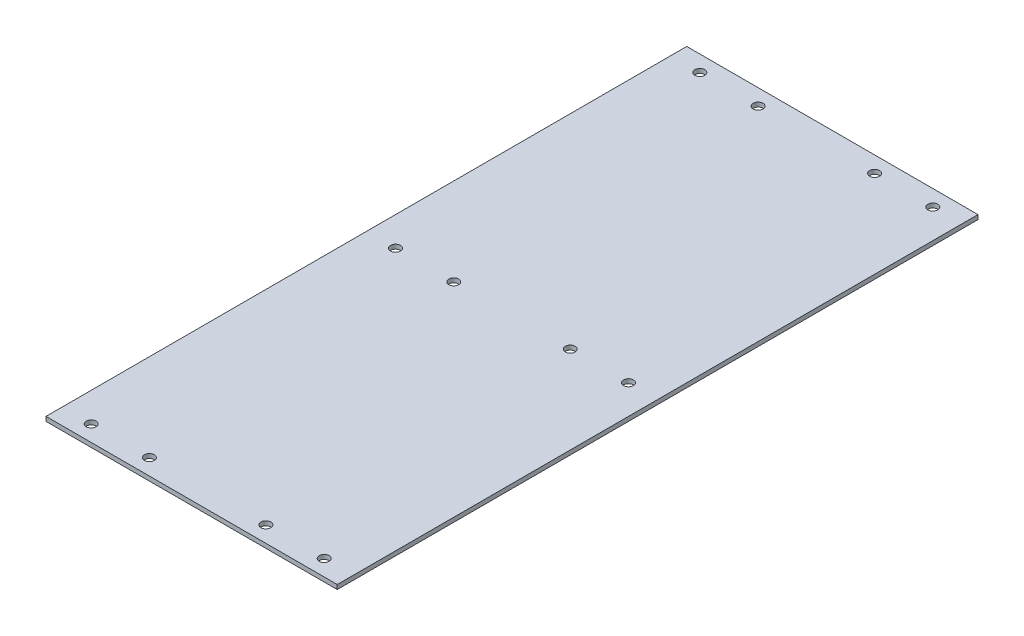
ISO-10303-21;
HEADER;
FILE_DESCRIPTION(('STEP AP214'),'2;1');
FILE_NAME('part.step','',(''),(''),'','','');
FILE_SCHEMA(('AUTOMOTIVE_DESIGN { 1 0 10303 214 1 1 1 1 }'));
ENDSEC;
DATA;
#1=APPLICATION_CONTEXT('core data for automotive mechanical design processes');
#2=APPLICATION_PROTOCOL_DEFINITION('international standard','automotive_design',2000,#1);
#3=PRODUCT_CONTEXT('',#1,'mechanical');
#4=PRODUCT('Part','Part','',(#3));
#5=PRODUCT_RELATED_PRODUCT_CATEGORY('part','',(#4));
#6=PRODUCT_DEFINITION_FORMATION('','',#4);
#7=PRODUCT_DEFINITION_CONTEXT('part definition',#1,'design');
#8=PRODUCT_DEFINITION('design','',#6,#7);
#9=PRODUCT_DEFINITION_SHAPE('','',#8);
#10=(LENGTH_UNIT() NAMED_UNIT(*) SI_UNIT(.MILLI.,.METRE.));
#11=(NAMED_UNIT(*) PLANE_ANGLE_UNIT() SI_UNIT($,.RADIAN.));
#12=(NAMED_UNIT(*) SI_UNIT($,.STERADIAN.) SOLID_ANGLE_UNIT());
#13=UNCERTAINTY_MEASURE_WITH_UNIT(LENGTH_MEASURE(1.E-05),#10,'distance_accuracy_value','');
#14=(GEOMETRIC_REPRESENTATION_CONTEXT(3) GLOBAL_UNCERTAINTY_ASSIGNED_CONTEXT((#13)) GLOBAL_UNIT_ASSIGNED_CONTEXT((#10,
#11,#12)) REPRESENTATION_CONTEXT('',''));
#15=CARTESIAN_POINT('',(0.,0.,0.));
#16=DIRECTION('',(0.,0.,1.));
#17=DIRECTION('',(1.,0.,0.));
#18=AXIS2_PLACEMENT_3D('',#15,#16,#17);
#19=CARTESIAN_POINT('',(-50.,46.95,-168.5));
#20=DIRECTION('',(-1.,0.,0.));
#21=DIRECTION('',(0.,0.,1.));
#22=AXIS2_PLACEMENT_3D('',#19,#20,#21);
#23=PLANE('',#22);
#24=DIRECTION('',(0.,-1.,0.));
#25=VECTOR('',#24,1.);
#26=CARTESIAN_POINT('',(-50.,46.95,51.5));
#27=LINE('',#26,#25);
#28=CARTESIAN_POINT('',(-50.,46.95,51.5));
#29=VERTEX_POINT('',#28);
#30=CARTESIAN_POINT('',(-50.,45.45,51.5));
#31=VERTEX_POINT('',#30);
#32=EDGE_CURVE('E85',#29,#31,#27,.T.);
#33=ORIENTED_EDGE('',*,*,#32,.F.);
#34=DIRECTION('',(0.,0.,1.));
#35=VECTOR('',#34,1.);
#36=CARTESIAN_POINT('',(-50.,46.95,-168.5));
#37=LINE('',#36,#35);
#38=CARTESIAN_POINT('',(-50.,46.95,-168.5));
#39=VERTEX_POINT('',#38);
#40=EDGE_CURVE('E20',#39,#29,#37,.T.);
#41=ORIENTED_EDGE('',*,*,#40,.F.);
#42=DIRECTION('',(0.,-1.,0.));
#43=VECTOR('',#42,1.);
#44=CARTESIAN_POINT('',(-50.,46.95,-168.5));
#45=LINE('',#44,#43);
#46=CARTESIAN_POINT('',(-50.,45.45,-168.5));
#47=VERTEX_POINT('',#46);
#48=EDGE_CURVE('E70',#39,#47,#45,.T.);
#49=ORIENTED_EDGE('',*,*,#48,.T.);
#50=DIRECTION('',(0.,0.,1.));
#51=VECTOR('',#50,1.);
#52=CARTESIAN_POINT('',(-50.,45.45,-168.5));
#53=LINE('',#52,#51);
#54=EDGE_CURVE('E11',#47,#31,#53,.T.);
#55=ORIENTED_EDGE('',*,*,#54,.T.);
#56=EDGE_LOOP('',(#33,#41,#49,#55));
#57=FACE_BOUND('',#56,.T.);
#58=ADVANCED_FACE('F17',(#57),#23,.T.);
#59=CARTESIAN_POINT('',(-46.3303607703069,45.45,-168.5));
#60=DIRECTION('',(0.,-1.,0.));
#61=DIRECTION('',(0.,0.,-1.));
#62=AXIS2_PLACEMENT_3D('',#59,#60,#61);
#63=PLANE('',#62);
#64=CARTESIAN_POINT('',(-40.,45.45,46.));
#65=DIRECTION('',(0.,-1.,0.));
#66=DIRECTION('',(0.,0.,-1.));
#67=AXIS2_PLACEMENT_3D('',#64,#65,#66);
#68=CIRCLE('',#67,1.7);
#69=CARTESIAN_POINT('',(-40.,45.45,44.3));
#70=VERTEX_POINT('',#69);
#71=EDGE_CURVE('E313',#70,#70,#68,.T.);
#72=ORIENTED_EDGE('',*,*,#71,.F.);
#73=EDGE_LOOP('',(#72));
#74=FACE_BOUND('',#73,.T.);
#75=CARTESIAN_POINT('',(-40.,45.45,-58.5));
#76=DIRECTION('',(0.,-1.,0.));
#77=DIRECTION('',(0.,0.,-1.));
#78=AXIS2_PLACEMENT_3D('',#75,#76,#77);
#79=CIRCLE('',#78,1.7);
#80=CARTESIAN_POINT('',(-40.,45.45,-60.2));
#81=VERTEX_POINT('',#80);
#82=EDGE_CURVE('E323',#81,#81,#79,.T.);
#83=ORIENTED_EDGE('',*,*,#82,.F.);
#84=EDGE_LOOP('',(#83));
#85=FACE_BOUND('',#84,.T.);
#86=CARTESIAN_POINT('',(-40.,45.45,-163.));
#87=DIRECTION('',(0.,-1.,0.));
#88=DIRECTION('',(0.,0.,-1.));
#89=AXIS2_PLACEMENT_3D('',#86,#87,#88);
#90=CIRCLE('',#89,1.7);
#91=CARTESIAN_POINT('',(-40.,45.45,-164.7));
#92=VERTEX_POINT('',#91);
#93=EDGE_CURVE('E329',#92,#92,#90,.T.);
#94=ORIENTED_EDGE('',*,*,#93,.F.);
#95=EDGE_LOOP('',(#94));
#96=FACE_BOUND('',#95,.T.);
#97=CARTESIAN_POINT('',(40.,45.45,-163.));
#98=DIRECTION('',(0.,-1.,0.));
#99=DIRECTION('',(0.,0.,-1.));
#100=AXIS2_PLACEMENT_3D('',#97,#98,#99);
#101=CIRCLE('',#100,1.7);
#102=CARTESIAN_POINT('',(40.,45.45,-164.7));
#103=VERTEX_POINT('',#102);
#104=EDGE_CURVE('E335',#103,#103,#101,.T.);
#105=ORIENTED_EDGE('',*,*,#104,.F.);
#106=EDGE_LOOP('',(#105));
#107=FACE_BOUND('',#106,.T.);
#108=CARTESIAN_POINT('',(40.,45.45,-58.5));
#109=DIRECTION('',(0.,-1.,0.));
#110=DIRECTION('',(0.,0.,-1.));
#111=AXIS2_PLACEMENT_3D('',#108,#109,#110);
#112=CIRCLE('',#111,1.7);
#113=CARTESIAN_POINT('',(40.,45.45,-60.2));
#114=VERTEX_POINT('',#113);
#115=EDGE_CURVE('E341',#114,#114,#112,.T.);
#116=ORIENTED_EDGE('',*,*,#115,.F.);
#117=EDGE_LOOP('',(#116));
#118=FACE_BOUND('',#117,.T.);
#119=CARTESIAN_POINT('',(40.,45.45,46.));
#120=DIRECTION('',(0.,-1.,0.));
#121=DIRECTION('',(0.,0.,-1.));
#122=AXIS2_PLACEMENT_3D('',#119,#120,#121);
#123=CIRCLE('',#122,1.7);
#124=CARTESIAN_POINT('',(40.,45.45,44.3));
#125=VERTEX_POINT('',#124);
#126=EDGE_CURVE('E347',#125,#125,#123,.T.);
#127=ORIENTED_EDGE('',*,*,#126,.F.);
#128=EDGE_LOOP('',(#127));
#129=FACE_BOUND('',#128,.T.);
#130=CARTESIAN_POINT('',(-20.,45.45,-163.));
#131=DIRECTION('',(0.,-1.,0.));
#132=DIRECTION('',(0.,0.,-1.));
#133=AXIS2_PLACEMENT_3D('',#130,#131,#132);
#134=CIRCLE('',#133,1.7);
#135=CARTESIAN_POINT('',(-20.,45.45,-164.7));
#136=VERTEX_POINT('',#135);
#137=EDGE_CURVE('E353',#136,#136,#134,.T.);
#138=ORIENTED_EDGE('',*,*,#137,.F.);
#139=EDGE_LOOP('',(#138));
#140=FACE_BOUND('',#139,.T.);
#141=CARTESIAN_POINT('',(20.,45.45,-163.));
#142=DIRECTION('',(0.,-1.,0.));
#143=DIRECTION('',(0.,0.,-1.));
#144=AXIS2_PLACEMENT_3D('',#141,#142,#143);
#145=CIRCLE('',#144,1.7);
#146=CARTESIAN_POINT('',(20.,45.45,-164.7));
#147=VERTEX_POINT('',#146);
#148=EDGE_CURVE('E359',#147,#147,#145,.T.);
#149=ORIENTED_EDGE('',*,*,#148,.F.);
#150=EDGE_LOOP('',(#149));
#151=FACE_BOUND('',#150,.T.);
#152=CARTESIAN_POINT('',(20.,45.45,-58.5));
#153=DIRECTION('',(0.,-1.,0.));
#154=DIRECTION('',(0.,0.,-1.));
#155=AXIS2_PLACEMENT_3D('',#152,#153,#154);
#156=CIRCLE('',#155,1.7);
#157=CARTESIAN_POINT('',(20.,45.45,-60.2));
#158=VERTEX_POINT('',#157);
#159=EDGE_CURVE('E365',#158,#158,#156,.T.);
#160=ORIENTED_EDGE('',*,*,#159,.F.);
#161=EDGE_LOOP('',(#160));
#162=FACE_BOUND('',#161,.T.);
#163=CARTESIAN_POINT('',(-20.,45.45,-58.5));
#164=DIRECTION('',(0.,-1.,0.));
#165=DIRECTION('',(0.,0.,-1.));
#166=AXIS2_PLACEMENT_3D('',#163,#164,#165);
#167=CIRCLE('',#166,1.7);
#168=CARTESIAN_POINT('',(-20.,45.45,-60.2));
#169=VERTEX_POINT('',#168);
#170=EDGE_CURVE('E371',#169,#169,#167,.T.);
#171=ORIENTED_EDGE('',*,*,#170,.F.);
#172=EDGE_LOOP('',(#171));
#173=FACE_BOUND('',#172,.T.);
#174=CARTESIAN_POINT('',(-20.,45.45,46.));
#175=DIRECTION('',(0.,-1.,0.));
#176=DIRECTION('',(0.,0.,-1.));
#177=AXIS2_PLACEMENT_3D('',#174,#175,#176);
#178=CIRCLE('',#177,1.7);
#179=CARTESIAN_POINT('',(-20.,45.45,44.3));
#180=VERTEX_POINT('',#179);
#181=EDGE_CURVE('E377',#180,#180,#178,.T.);
#182=ORIENTED_EDGE('',*,*,#181,.F.);
#183=EDGE_LOOP('',(#182));
#184=FACE_BOUND('',#183,.T.);
#185=CARTESIAN_POINT('',(20.,45.45,46.));
#186=DIRECTION('',(0.,-1.,0.));
#187=DIRECTION('',(0.,0.,-1.));
#188=AXIS2_PLACEMENT_3D('',#185,#186,#187);
#189=CIRCLE('',#188,1.7);
#190=CARTESIAN_POINT('',(20.,45.45,44.3));
#191=VERTEX_POINT('',#190);
#192=EDGE_CURVE('E79',#191,#191,#189,.T.);
#193=ORIENTED_EDGE('',*,*,#192,.F.);
#194=EDGE_LOOP('',(#193));
#195=FACE_BOUND('',#194,.T.);
#196=DIRECTION('',(1.,0.,0.));
#197=VECTOR('',#196,1.);
#198=CARTESIAN_POINT('',(-46.3303607703069,45.45,51.5));
#199=LINE('',#198,#197);
#200=CARTESIAN_POINT('',(50.,45.45,51.5));
#201=VERTEX_POINT('',#200);
#202=EDGE_CURVE('E63',#31,#201,#199,.T.);
#203=ORIENTED_EDGE('',*,*,#202,.F.);
#204=ORIENTED_EDGE('',*,*,#54,.F.);
#205=DIRECTION('',(1.,0.,0.));
#206=VECTOR('',#205,1.);
#207=CARTESIAN_POINT('',(-50.,45.45,-168.5));
#208=LINE('',#207,#206);
#209=CARTESIAN_POINT('',(50.,45.45,-168.5));
#210=VERTEX_POINT('',#209);
#211=EDGE_CURVE('E61',#47,#210,#208,.T.);
#212=ORIENTED_EDGE('',*,*,#211,.T.);
#213=DIRECTION('',(0.,0.,1.));
#214=VECTOR('',#213,1.);
#215=CARTESIAN_POINT('',(50.,45.45,-168.5));
#216=LINE('',#215,#214);
#217=EDGE_CURVE('E26',#210,#201,#216,.T.);
#218=ORIENTED_EDGE('',*,*,#217,.T.);
#219=EDGE_LOOP('',(#203,#204,#212,#218));
#220=FACE_BOUND('',#219,.T.);
#221=ADVANCED_FACE('F60',(#74,#85,#96,#107,#118,#129,#140,#151,#162,#173,#184,#195,#220),#63,.T.);
#222=CARTESIAN_POINT('',(50.,45.45,-168.5));
#223=DIRECTION('',(1.,0.,0.));
#224=DIRECTION('',(0.,0.,-1.));
#225=AXIS2_PLACEMENT_3D('',#222,#223,#224);
#226=PLANE('',#225);
#227=DIRECTION('',(0.,1.,0.));
#228=VECTOR('',#227,1.);
#229=CARTESIAN_POINT('',(50.,45.45,51.5));
#230=LINE('',#229,#228);
#231=CARTESIAN_POINT('',(50.,46.95,51.5));
#232=VERTEX_POINT('',#231);
#233=EDGE_CURVE('E76',#201,#232,#230,.T.);
#234=ORIENTED_EDGE('',*,*,#233,.F.);
#235=ORIENTED_EDGE('',*,*,#217,.F.);
#236=DIRECTION('',(0.,1.,0.));
#237=VECTOR('',#236,1.);
#238=CARTESIAN_POINT('',(50.,45.45,-168.5));
#239=LINE('',#238,#237);
#240=CARTESIAN_POINT('',(50.,46.95,-168.5));
#241=VERTEX_POINT('',#240);
#242=EDGE_CURVE('E71',#210,#241,#239,.T.);
#243=ORIENTED_EDGE('',*,*,#242,.T.);
#244=DIRECTION('',(0.,0.,1.));
#245=VECTOR('',#244,1.);
#246=CARTESIAN_POINT('',(50.,46.95,-168.5));
#247=LINE('',#246,#245);
#248=EDGE_CURVE('E34',#241,#232,#247,.T.);
#249=ORIENTED_EDGE('',*,*,#248,.T.);
#250=EDGE_LOOP('',(#234,#235,#243,#249));
#251=FACE_BOUND('',#250,.T.);
#252=ADVANCED_FACE('F94',(#251),#226,.T.);
#253=CARTESIAN_POINT('',(50.,46.95,-168.5));
#254=DIRECTION('',(0.,1.,0.));
#255=DIRECTION('',(0.,0.,1.));
#256=AXIS2_PLACEMENT_3D('',#253,#254,#255);
#257=PLANE('',#256);
#258=CARTESIAN_POINT('',(-40.,46.95,46.));
#259=DIRECTION('',(0.,-1.,0.));
#260=DIRECTION('',(0.,0.,-1.));
#261=AXIS2_PLACEMENT_3D('',#258,#259,#260);
#262=CIRCLE('',#261,1.7);
#263=CARTESIAN_POINT('',(-40.,46.95,44.3));
#264=VERTEX_POINT('',#263);
#265=EDGE_CURVE('E316',#264,#264,#262,.T.);
#266=ORIENTED_EDGE('',*,*,#265,.T.);
#267=EDGE_LOOP('',(#266));
#268=FACE_BOUND('',#267,.T.);
#269=CARTESIAN_POINT('',(-40.,46.95,-58.5));
#270=DIRECTION('',(0.,-1.,0.));
#271=DIRECTION('',(0.,0.,-1.));
#272=AXIS2_PLACEMENT_3D('',#269,#270,#271);
#273=CIRCLE('',#272,1.7);
#274=CARTESIAN_POINT('',(-40.,46.95,-60.2));
#275=VERTEX_POINT('',#274);
#276=EDGE_CURVE('E318',#275,#275,#273,.T.);
#277=ORIENTED_EDGE('',*,*,#276,.T.);
#278=EDGE_LOOP('',(#277));
#279=FACE_BOUND('',#278,.T.);
#280=CARTESIAN_POINT('',(-40.,46.95,-163.));
#281=DIRECTION('',(0.,-1.,0.));
#282=DIRECTION('',(0.,0.,-1.));
#283=AXIS2_PLACEMENT_3D('',#280,#281,#282);
#284=CIRCLE('',#283,1.7);
#285=CARTESIAN_POINT('',(-40.,46.95,-164.7));
#286=VERTEX_POINT('',#285);
#287=EDGE_CURVE('E326',#286,#286,#284,.T.);
#288=ORIENTED_EDGE('',*,*,#287,.T.);
#289=EDGE_LOOP('',(#288));
#290=FACE_BOUND('',#289,.T.);
#291=CARTESIAN_POINT('',(40.,46.95,-163.));
#292=DIRECTION('',(0.,-1.,0.));
#293=DIRECTION('',(0.,0.,-1.));
#294=AXIS2_PLACEMENT_3D('',#291,#292,#293);
#295=CIRCLE('',#294,1.7);
#296=CARTESIAN_POINT('',(40.,46.95,-164.7));
#297=VERTEX_POINT('',#296);
#298=EDGE_CURVE('E332',#297,#297,#295,.T.);
#299=ORIENTED_EDGE('',*,*,#298,.T.);
#300=EDGE_LOOP('',(#299));
#301=FACE_BOUND('',#300,.T.);
#302=CARTESIAN_POINT('',(40.,46.95,-58.5));
#303=DIRECTION('',(0.,-1.,0.));
#304=DIRECTION('',(0.,0.,-1.));
#305=AXIS2_PLACEMENT_3D('',#302,#303,#304);
#306=CIRCLE('',#305,1.7);
#307=CARTESIAN_POINT('',(40.,46.95,-60.2));
#308=VERTEX_POINT('',#307);
#309=EDGE_CURVE('E338',#308,#308,#306,.T.);
#310=ORIENTED_EDGE('',*,*,#309,.T.);
#311=EDGE_LOOP('',(#310));
#312=FACE_BOUND('',#311,.T.);
#313=CARTESIAN_POINT('',(40.,46.95,46.));
#314=DIRECTION('',(0.,-1.,0.));
#315=DIRECTION('',(0.,0.,-1.));
#316=AXIS2_PLACEMENT_3D('',#313,#314,#315);
#317=CIRCLE('',#316,1.7);
#318=CARTESIAN_POINT('',(40.,46.95,44.3));
#319=VERTEX_POINT('',#318);
#320=EDGE_CURVE('E344',#319,#319,#317,.T.);
#321=ORIENTED_EDGE('',*,*,#320,.T.);
#322=EDGE_LOOP('',(#321));
#323=FACE_BOUND('',#322,.T.);
#324=CARTESIAN_POINT('',(-20.,46.95,-163.));
#325=DIRECTION('',(0.,-1.,0.));
#326=DIRECTION('',(0.,0.,-1.));
#327=AXIS2_PLACEMENT_3D('',#324,#325,#326);
#328=CIRCLE('',#327,1.7);
#329=CARTESIAN_POINT('',(-20.,46.95,-164.7));
#330=VERTEX_POINT('',#329);
#331=EDGE_CURVE('E350',#330,#330,#328,.T.);
#332=ORIENTED_EDGE('',*,*,#331,.T.);
#333=EDGE_LOOP('',(#332));
#334=FACE_BOUND('',#333,.T.);
#335=CARTESIAN_POINT('',(20.,46.95,-163.));
#336=DIRECTION('',(0.,-1.,0.));
#337=DIRECTION('',(0.,0.,-1.));
#338=AXIS2_PLACEMENT_3D('',#335,#336,#337);
#339=CIRCLE('',#338,1.7);
#340=CARTESIAN_POINT('',(20.,46.95,-164.7));
#341=VERTEX_POINT('',#340);
#342=EDGE_CURVE('E356',#341,#341,#339,.T.);
#343=ORIENTED_EDGE('',*,*,#342,.T.);
#344=EDGE_LOOP('',(#343));
#345=FACE_BOUND('',#344,.T.);
#346=CARTESIAN_POINT('',(20.,46.95,-58.5));
#347=DIRECTION('',(0.,-1.,0.));
#348=DIRECTION('',(0.,0.,-1.));
#349=AXIS2_PLACEMENT_3D('',#346,#347,#348);
#350=CIRCLE('',#349,1.7);
#351=CARTESIAN_POINT('',(20.,46.95,-60.2));
#352=VERTEX_POINT('',#351);
#353=EDGE_CURVE('E362',#352,#352,#350,.T.);
#354=ORIENTED_EDGE('',*,*,#353,.T.);
#355=EDGE_LOOP('',(#354));
#356=FACE_BOUND('',#355,.T.);
#357=CARTESIAN_POINT('',(-20.,46.95,-58.5));
#358=DIRECTION('',(0.,-1.,0.));
#359=DIRECTION('',(0.,0.,-1.));
#360=AXIS2_PLACEMENT_3D('',#357,#358,#359);
#361=CIRCLE('',#360,1.7);
#362=CARTESIAN_POINT('',(-20.,46.95,-60.2));
#363=VERTEX_POINT('',#362);
#364=EDGE_CURVE('E368',#363,#363,#361,.T.);
#365=ORIENTED_EDGE('',*,*,#364,.T.);
#366=EDGE_LOOP('',(#365));
#367=FACE_BOUND('',#366,.T.);
#368=CARTESIAN_POINT('',(-20.,46.95,46.));
#369=DIRECTION('',(0.,-1.,0.));
#370=DIRECTION('',(0.,0.,-1.));
#371=AXIS2_PLACEMENT_3D('',#368,#369,#370);
#372=CIRCLE('',#371,1.7);
#373=CARTESIAN_POINT('',(-20.,46.95,44.3));
#374=VERTEX_POINT('',#373);
#375=EDGE_CURVE('E374',#374,#374,#372,.T.);
#376=ORIENTED_EDGE('',*,*,#375,.T.);
#377=EDGE_LOOP('',(#376));
#378=FACE_BOUND('',#377,.T.);
#379=CARTESIAN_POINT('',(20.,46.95,46.));
#380=DIRECTION('',(0.,-1.,0.));
#381=DIRECTION('',(0.,0.,-1.));
#382=AXIS2_PLACEMENT_3D('',#379,#380,#381);
#383=CIRCLE('',#382,1.7);
#384=CARTESIAN_POINT('',(20.,46.95,44.3));
#385=VERTEX_POINT('',#384);
#386=EDGE_CURVE('E379',#385,#385,#383,.T.);
#387=ORIENTED_EDGE('',*,*,#386,.T.);
#388=EDGE_LOOP('',(#387));
#389=FACE_BOUND('',#388,.T.);
#390=DIRECTION('',(-1.,0.,0.));
#391=VECTOR('',#390,1.);
#392=CARTESIAN_POINT('',(50.,46.95,51.5));
#393=LINE('',#392,#391);
#394=EDGE_CURVE('E73',#232,#29,#393,.T.);
#395=ORIENTED_EDGE('',*,*,#394,.F.);
#396=ORIENTED_EDGE('',*,*,#248,.F.);
#397=DIRECTION('',(-1.,0.,0.));
#398=VECTOR('',#397,1.);
#399=CARTESIAN_POINT('',(50.,46.95,-168.5));
#400=LINE('',#399,#398);
#401=EDGE_CURVE('E83',#241,#39,#400,.T.);
#402=ORIENTED_EDGE('',*,*,#401,.T.);
#403=ORIENTED_EDGE('',*,*,#40,.T.);
#404=EDGE_LOOP('',(#395,#396,#402,#403));
#405=FACE_BOUND('',#404,.T.);
#406=ADVANCED_FACE('F91',(#268,#279,#290,#301,#312,#323,#334,#345,#356,#367,#378,#389,#405),
#257,.T.);
#407=CARTESIAN_POINT('',(0.,0.,-168.5));
#408=DIRECTION('',(0.,0.,1.));
#409=DIRECTION('',(1.,0.,0.));
#410=AXIS2_PLACEMENT_3D('',#407,#408,#409);
#411=PLANE('',#410);
#412=ORIENTED_EDGE('',*,*,#48,.F.);
#413=ORIENTED_EDGE('',*,*,#401,.F.);
#414=ORIENTED_EDGE('',*,*,#242,.F.);
#415=ORIENTED_EDGE('',*,*,#211,.F.);
#416=EDGE_LOOP('',(#412,#413,#414,#415));
#417=FACE_BOUND('',#416,.T.);
#418=ADVANCED_FACE('F68',(#417),#411,.F.);
#419=CARTESIAN_POINT('',(0.,0.,51.5));
#420=DIRECTION('',(0.,0.,1.));
#421=DIRECTION('',(1.,0.,0.));
#422=AXIS2_PLACEMENT_3D('',#419,#420,#421);
#423=PLANE('',#422);
#424=ORIENTED_EDGE('',*,*,#32,.T.);
#425=ORIENTED_EDGE('',*,*,#202,.T.);
#426=ORIENTED_EDGE('',*,*,#233,.T.);
#427=ORIENTED_EDGE('',*,*,#394,.T.);
#428=EDGE_LOOP('',(#424,#425,#426,#427));
#429=FACE_BOUND('',#428,.T.);
#430=ADVANCED_FACE('F93',(#429),#423,.T.);
#431=CARTESIAN_POINT('',(20.,46.95,46.));
#432=DIRECTION('',(0.,-1.,0.));
#433=DIRECTION('',(0.,0.,-1.));
#434=AXIS2_PLACEMENT_3D('',#431,#432,#433);
#435=CYLINDRICAL_SURFACE('',#434,1.7);
#436=ORIENTED_EDGE('',*,*,#192,.T.);
#437=EDGE_LOOP('',(#436));
#438=FACE_BOUND('',#437,.T.);
#439=ORIENTED_EDGE('',*,*,#386,.F.);
#440=EDGE_LOOP('',(#439));
#441=FACE_BOUND('',#440,.T.);
#442=ADVANCED_FACE('F151',(#438,#441),#435,.F.);
#443=CARTESIAN_POINT('',(-20.,46.95,46.));
#444=DIRECTION('',(0.,-1.,0.));
#445=DIRECTION('',(0.,0.,-1.));
#446=AXIS2_PLACEMENT_3D('',#443,#444,#445);
#447=CYLINDRICAL_SURFACE('',#446,1.7);
#448=ORIENTED_EDGE('',*,*,#181,.T.);
#449=EDGE_LOOP('',(#448));
#450=FACE_BOUND('',#449,.T.);
#451=ORIENTED_EDGE('',*,*,#375,.F.);
#452=EDGE_LOOP('',(#451));
#453=FACE_BOUND('',#452,.T.);
#454=ADVANCED_FACE('F161',(#450,#453),#447,.F.);
#455=CARTESIAN_POINT('',(-20.,46.95,-58.5));
#456=DIRECTION('',(0.,-1.,0.));
#457=DIRECTION('',(0.,0.,-1.));
#458=AXIS2_PLACEMENT_3D('',#455,#456,#457);
#459=CYLINDRICAL_SURFACE('',#458,1.7);
#460=ORIENTED_EDGE('',*,*,#170,.T.);
#461=EDGE_LOOP('',(#460));
#462=FACE_BOUND('',#461,.T.);
#463=ORIENTED_EDGE('',*,*,#364,.F.);
#464=EDGE_LOOP('',(#463));
#465=FACE_BOUND('',#464,.T.);
#466=ADVANCED_FACE('F172',(#462,#465),#459,.F.);
#467=CARTESIAN_POINT('',(20.,46.95,-58.5));
#468=DIRECTION('',(0.,-1.,0.));
#469=DIRECTION('',(0.,0.,-1.));
#470=AXIS2_PLACEMENT_3D('',#467,#468,#469);
#471=CYLINDRICAL_SURFACE('',#470,1.7);
#472=ORIENTED_EDGE('',*,*,#159,.T.);
#473=EDGE_LOOP('',(#472));
#474=FACE_BOUND('',#473,.T.);
#475=ORIENTED_EDGE('',*,*,#353,.F.);
#476=EDGE_LOOP('',(#475));
#477=FACE_BOUND('',#476,.T.);
#478=ADVANCED_FACE('F183',(#474,#477),#471,.F.);
#479=CARTESIAN_POINT('',(20.,46.95,-163.));
#480=DIRECTION('',(0.,-1.,0.));
#481=DIRECTION('',(0.,0.,-1.));
#482=AXIS2_PLACEMENT_3D('',#479,#480,#481);
#483=CYLINDRICAL_SURFACE('',#482,1.7);
#484=ORIENTED_EDGE('',*,*,#148,.T.);
#485=EDGE_LOOP('',(#484));
#486=FACE_BOUND('',#485,.T.);
#487=ORIENTED_EDGE('',*,*,#342,.F.);
#488=EDGE_LOOP('',(#487));
#489=FACE_BOUND('',#488,.T.);
#490=ADVANCED_FACE('F194',(#486,#489),#483,.F.);
#491=CARTESIAN_POINT('',(-20.,46.95,-163.));
#492=DIRECTION('',(0.,-1.,0.));
#493=DIRECTION('',(0.,0.,-1.));
#494=AXIS2_PLACEMENT_3D('',#491,#492,#493);
#495=CYLINDRICAL_SURFACE('',#494,1.7);
#496=ORIENTED_EDGE('',*,*,#137,.T.);
#497=EDGE_LOOP('',(#496));
#498=FACE_BOUND('',#497,.T.);
#499=ORIENTED_EDGE('',*,*,#331,.F.);
#500=EDGE_LOOP('',(#499));
#501=FACE_BOUND('',#500,.T.);
#502=ADVANCED_FACE('F205',(#498,#501),#495,.F.);
#503=CARTESIAN_POINT('',(40.,46.95,46.));
#504=DIRECTION('',(0.,-1.,0.));
#505=DIRECTION('',(0.,0.,-1.));
#506=AXIS2_PLACEMENT_3D('',#503,#504,#505);
#507=CYLINDRICAL_SURFACE('',#506,1.7);
#508=ORIENTED_EDGE('',*,*,#126,.T.);
#509=EDGE_LOOP('',(#508));
#510=FACE_BOUND('',#509,.T.);
#511=ORIENTED_EDGE('',*,*,#320,.F.);
#512=EDGE_LOOP('',(#511));
#513=FACE_BOUND('',#512,.T.);
#514=ADVANCED_FACE('F216',(#510,#513),#507,.F.);
#515=CARTESIAN_POINT('',(40.,46.95,-58.5));
#516=DIRECTION('',(0.,-1.,0.));
#517=DIRECTION('',(0.,0.,-1.));
#518=AXIS2_PLACEMENT_3D('',#515,#516,#517);
#519=CYLINDRICAL_SURFACE('',#518,1.7);
#520=ORIENTED_EDGE('',*,*,#115,.T.);
#521=EDGE_LOOP('',(#520));
#522=FACE_BOUND('',#521,.T.);
#523=ORIENTED_EDGE('',*,*,#309,.F.);
#524=EDGE_LOOP('',(#523));
#525=FACE_BOUND('',#524,.T.);
#526=ADVANCED_FACE('F227',(#522,#525),#519,.F.);
#527=CARTESIAN_POINT('',(40.,46.95,-163.));
#528=DIRECTION('',(0.,-1.,0.));
#529=DIRECTION('',(0.,0.,-1.));
#530=AXIS2_PLACEMENT_3D('',#527,#528,#529);
#531=CYLINDRICAL_SURFACE('',#530,1.7);
#532=ORIENTED_EDGE('',*,*,#104,.T.);
#533=EDGE_LOOP('',(#532));
#534=FACE_BOUND('',#533,.T.);
#535=ORIENTED_EDGE('',*,*,#298,.F.);
#536=EDGE_LOOP('',(#535));
#537=FACE_BOUND('',#536,.T.);
#538=ADVANCED_FACE('F238',(#534,#537),#531,.F.);
#539=CARTESIAN_POINT('',(-40.,46.95,-163.));
#540=DIRECTION('',(0.,-1.,0.));
#541=DIRECTION('',(0.,0.,-1.));
#542=AXIS2_PLACEMENT_3D('',#539,#540,#541);
#543=CYLINDRICAL_SURFACE('',#542,1.7);
#544=ORIENTED_EDGE('',*,*,#93,.T.);
#545=EDGE_LOOP('',(#544));
#546=FACE_BOUND('',#545,.T.);
#547=ORIENTED_EDGE('',*,*,#287,.F.);
#548=EDGE_LOOP('',(#547));
#549=FACE_BOUND('',#548,.T.);
#550=ADVANCED_FACE('F249',(#546,#549),#543,.F.);
#551=CARTESIAN_POINT('',(-40.,46.95,-58.5));
#552=DIRECTION('',(0.,-1.,0.));
#553=DIRECTION('',(0.,0.,-1.));
#554=AXIS2_PLACEMENT_3D('',#551,#552,#553);
#555=CYLINDRICAL_SURFACE('',#554,1.7);
#556=ORIENTED_EDGE('',*,*,#82,.T.);
#557=EDGE_LOOP('',(#556));
#558=FACE_BOUND('',#557,.T.);
#559=ORIENTED_EDGE('',*,*,#276,.F.);
#560=EDGE_LOOP('',(#559));
#561=FACE_BOUND('',#560,.T.);
#562=ADVANCED_FACE('F260',(#558,#561),#555,.F.);
#563=CARTESIAN_POINT('',(-40.,46.95,46.));
#564=DIRECTION('',(0.,-1.,0.));
#565=DIRECTION('',(0.,0.,-1.));
#566=AXIS2_PLACEMENT_3D('',#563,#564,#565);
#567=CYLINDRICAL_SURFACE('',#566,1.7);
#568=ORIENTED_EDGE('',*,*,#71,.T.);
#569=EDGE_LOOP('',(#568));
#570=FACE_BOUND('',#569,.T.);
#571=ORIENTED_EDGE('',*,*,#265,.F.);
#572=EDGE_LOOP('',(#571));
#573=FACE_BOUND('',#572,.T.);
#574=ADVANCED_FACE('F271',(#570,#573),#567,.F.);
#575=CLOSED_SHELL('',(#58,#221,#252,#406,#418,#430,#442,#454,#466,#478,#490,#502,#514,#526,#538,
#550,#562,#574));
#576=MANIFOLD_SOLID_BREP('B1',#575);
#577=ADVANCED_BREP_SHAPE_REPRESENTATION('',(#18,#576),#14);
#578=SHAPE_DEFINITION_REPRESENTATION(#9,#577);
ENDSEC;
END-ISO-10303-21;
